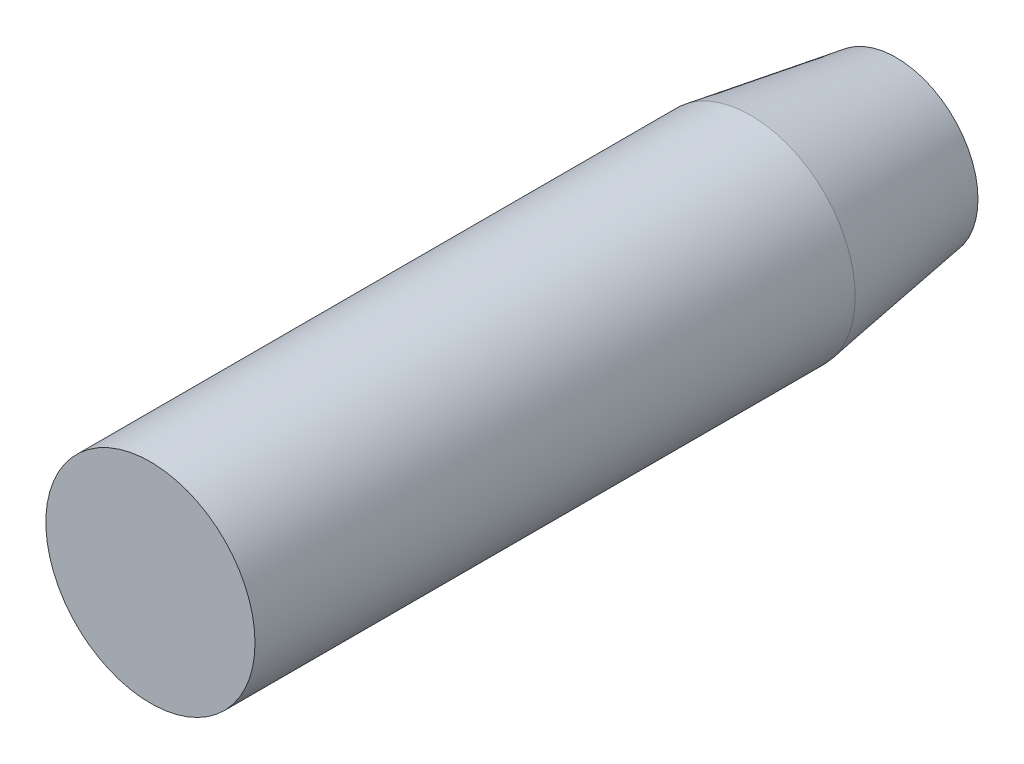
ISO-10303-21;
HEADER;
FILE_DESCRIPTION(('STEP AP214'),'2;1');
FILE_NAME('part.step','',(''),(''),'','','');
FILE_SCHEMA(('AUTOMOTIVE_DESIGN { 1 0 10303 214 1 1 1 1 }'));
ENDSEC;
DATA;
#1=APPLICATION_CONTEXT('core data for automotive mechanical design processes');
#2=APPLICATION_PROTOCOL_DEFINITION('international standard','automotive_design',2000,#1);
#3=PRODUCT_CONTEXT('',#1,'mechanical');
#4=PRODUCT('Part','Part','',(#3));
#5=PRODUCT_RELATED_PRODUCT_CATEGORY('part','',(#4));
#6=PRODUCT_DEFINITION_FORMATION('','',#4);
#7=PRODUCT_DEFINITION_CONTEXT('part definition',#1,'design');
#8=PRODUCT_DEFINITION('design','',#6,#7);
#9=PRODUCT_DEFINITION_SHAPE('','',#8);
#10=(LENGTH_UNIT() NAMED_UNIT(*) SI_UNIT(.MILLI.,.METRE.));
#11=(NAMED_UNIT(*) PLANE_ANGLE_UNIT() SI_UNIT($,.RADIAN.));
#12=(NAMED_UNIT(*) SI_UNIT($,.STERADIAN.) SOLID_ANGLE_UNIT());
#13=UNCERTAINTY_MEASURE_WITH_UNIT(LENGTH_MEASURE(1.E-05),#10,'distance_accuracy_value','');
#14=(GEOMETRIC_REPRESENTATION_CONTEXT(3) GLOBAL_UNCERTAINTY_ASSIGNED_CONTEXT((#13)) GLOBAL_UNIT_ASSIGNED_CONTEXT((#10,
#11,#12)) REPRESENTATION_CONTEXT('',''));
#15=CARTESIAN_POINT('',(0.,0.,0.));
#16=DIRECTION('',(0.,0.,1.));
#17=DIRECTION('',(1.,0.,0.));
#18=AXIS2_PLACEMENT_3D('',#15,#16,#17);
#19=CARTESIAN_POINT('',(0.,0.,-65.0875));
#20=DIRECTION('',(0.,0.,1.));
#21=DIRECTION('',(-1.,0.,0.));
#22=AXIS2_PLACEMENT_3D('',#19,#20,#21);
#23=CYLINDRICAL_SURFACE('',#22,18.25625);
#24=CARTESIAN_POINT('',(0.,0.,-39.6874999999998));
#25=DIRECTION('',(0.,0.,1.));
#26=DIRECTION('',(1.,0.,0.));
#27=AXIS2_PLACEMENT_3D('',#24,#25,#26);
#28=CIRCLE('',#27,18.25625);
#29=CARTESIAN_POINT('',(18.25625,0.,-39.6874999999998));
#30=VERTEX_POINT('',#29);
#31=EDGE_CURVE('E10',#30,#30,#28,.F.);
#32=ORIENTED_EDGE('',*,*,#31,.F.);
#33=EDGE_LOOP('',(#32));
#34=FACE_BOUND('',#33,.T.);
#35=CARTESIAN_POINT('',(0.,0.,65.0875));
#36=DIRECTION('',(0.,0.,1.));
#37=DIRECTION('',(1.,0.,0.));
#38=AXIS2_PLACEMENT_3D('',#35,#36,#37);
#39=CIRCLE('',#38,18.25625);
#40=CARTESIAN_POINT('',(18.25625,0.,65.0875));
#41=VERTEX_POINT('',#40);
#42=EDGE_CURVE('E46',#41,#41,#39,.T.);
#43=ORIENTED_EDGE('',*,*,#42,.F.);
#44=EDGE_LOOP('',(#43));
#45=FACE_BOUND('',#44,.T.);
#46=ADVANCED_FACE('F35',(#34,#45),#23,.T.);
#47=CARTESIAN_POINT('',(0.,0.,-65.0875));
#48=DIRECTION('',(0.,0.,-1.));
#49=DIRECTION('',(1.,0.,0.));
#50=AXIS2_PLACEMENT_3D('',#47,#48,#49);
#51=PLANE('',#50);
#52=CARTESIAN_POINT('',(0.,0.,-65.0875));
#53=DIRECTION('',(0.,0.,1.));
#54=DIRECTION('',(1.,0.,0.));
#55=AXIS2_PLACEMENT_3D('',#52,#53,#54);
#56=CIRCLE('',#55,14.2875000000001);
#57=CARTESIAN_POINT('',(14.2875000000001,0.,-65.0875));
#58=VERTEX_POINT('',#57);
#59=EDGE_CURVE('E42',#58,#58,#56,.T.);
#60=ORIENTED_EDGE('',*,*,#59,.F.);
#61=EDGE_LOOP('',(#60));
#62=FACE_BOUND('',#61,.T.);
#63=ADVANCED_FACE('F56',(#62),#51,.T.);
#64=CARTESIAN_POINT('',(0.,0.,65.0875));
#65=DIRECTION('',(0.,0.,-1.));
#66=DIRECTION('',(1.,0.,0.));
#67=AXIS2_PLACEMENT_3D('',#64,#65,#66);
#68=PLANE('',#67);
#69=ORIENTED_EDGE('',*,*,#42,.T.);
#70=EDGE_LOOP('',(#69));
#71=FACE_BOUND('',#70,.T.);
#72=ADVANCED_FACE('F53',(#71),#68,.F.);
#73=CARTESIAN_POINT('',(0.,0.,-65.0875));
#74=DIRECTION('',(0.,0.,1.));
#75=DIRECTION('',(-1.,0.,0.));
#76=AXIS2_PLACEMENT_3D('',#73,#74,#75);
#77=CONICAL_SURFACE('',#76,14.2875000000001,0.154996741923938);
#78=ORIENTED_EDGE('',*,*,#31,.T.);
#79=EDGE_LOOP('',(#78));
#80=FACE_BOUND('',#79,.T.);
#81=ORIENTED_EDGE('',*,*,#59,.T.);
#82=EDGE_LOOP('',(#81));
#83=FACE_BOUND('',#82,.T.);
#84=ADVANCED_FACE('F37',(#80,#83),#77,.T.);
#85=CLOSED_SHELL('',(#46,#63,#72,#84));
#86=MANIFOLD_SOLID_BREP('B2',#85);
#87=ADVANCED_BREP_SHAPE_REPRESENTATION('',(#18,#86),#14);
#88=SHAPE_DEFINITION_REPRESENTATION(#9,#87);
ENDSEC;
END-ISO-10303-21;
